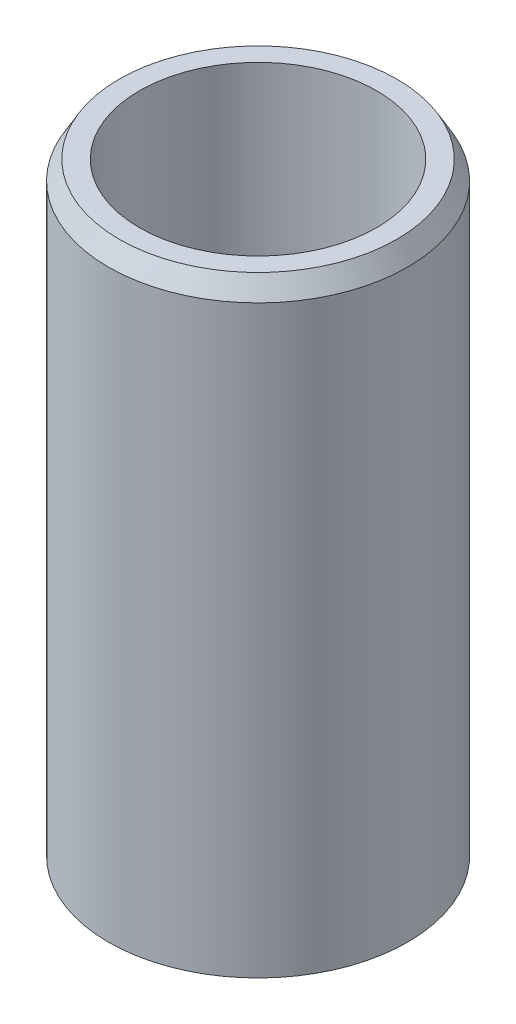
ISO-10303-21;
HEADER;
FILE_DESCRIPTION(('STEP AP214'),'2;1');
FILE_NAME('part.step','',(''),(''),'','','');
FILE_SCHEMA(('AUTOMOTIVE_DESIGN { 1 0 10303 214 1 1 1 1 }'));
ENDSEC;
DATA;
#1=APPLICATION_CONTEXT('core data for automotive mechanical design processes');
#2=APPLICATION_PROTOCOL_DEFINITION('international standard','automotive_design',2000,#1);
#3=PRODUCT_CONTEXT('',#1,'mechanical');
#4=PRODUCT('Part','Part','',(#3));
#5=PRODUCT_RELATED_PRODUCT_CATEGORY('part','',(#4));
#6=PRODUCT_DEFINITION_FORMATION('','',#4);
#7=PRODUCT_DEFINITION_CONTEXT('part definition',#1,'design');
#8=PRODUCT_DEFINITION('design','',#6,#7);
#9=PRODUCT_DEFINITION_SHAPE('','',#8);
#10=(LENGTH_UNIT() NAMED_UNIT(*) SI_UNIT(.MILLI.,.METRE.));
#11=(NAMED_UNIT(*) PLANE_ANGLE_UNIT() SI_UNIT($,.RADIAN.));
#12=(NAMED_UNIT(*) SI_UNIT($,.STERADIAN.) SOLID_ANGLE_UNIT());
#13=UNCERTAINTY_MEASURE_WITH_UNIT(LENGTH_MEASURE(1.E-05),#10,'distance_accuracy_value','');
#14=(GEOMETRIC_REPRESENTATION_CONTEXT(3) GLOBAL_UNCERTAINTY_ASSIGNED_CONTEXT((#13)) GLOBAL_UNIT_ASSIGNED_CONTEXT((#10,
#11,#12)) REPRESENTATION_CONTEXT('',''));
#15=CARTESIAN_POINT('',(0.,0.,0.));
#16=DIRECTION('',(0.,0.,1.));
#17=DIRECTION('',(1.,0.,0.));
#18=AXIS2_PLACEMENT_3D('',#15,#16,#17);
#19=CARTESIAN_POINT('',(0.,174.486426869401,0.));
#20=DIRECTION('',(0.,-1.,0.));
#21=DIRECTION('',(0.,0.,-1.));
#22=AXIS2_PLACEMENT_3D('',#19,#20,#21);
#23=CYLINDRICAL_SURFACE('',#22,42.5);
#24=CARTESIAN_POINT('',(0.,169.170628258907,0.));
#25=DIRECTION('',(0.,1.,0.));
#26=DIRECTION('',(0.,0.,1.));
#27=AXIS2_PLACEMENT_3D('',#24,#25,#26);
#28=CIRCLE('',#27,42.5);
#29=CARTESIAN_POINT('',(0.,169.170628258907,42.5));
#30=VERTEX_POINT('',#29);
#31=EDGE_CURVE('E50',#30,#30,#28,.F.);
#32=ORIENTED_EDGE('',*,*,#31,.T.);
#33=EDGE_LOOP('',(#32));
#34=FACE_BOUND('',#33,.T.);
#35=CARTESIAN_POINT('',(0.,3.06907775872634,0.));
#36=DIRECTION('',(0.,1.,0.));
#37=DIRECTION('',(0.,0.,1.));
#38=AXIS2_PLACEMENT_3D('',#35,#36,#37);
#39=CIRCLE('',#38,42.5);
#40=CARTESIAN_POINT('',(0.,3.06907775872633,42.5));
#41=VERTEX_POINT('',#40);
#42=EDGE_CURVE('E51',#41,#41,#39,.T.);
#43=ORIENTED_EDGE('',*,*,#42,.T.);
#44=EDGE_LOOP('',(#43));
#45=FACE_BOUND('',#44,.T.);
#46=ADVANCED_FACE('F39',(#34,#45),#23,.T.);
#47=CARTESIAN_POINT('',(0.,174.486426869401,0.));
#48=DIRECTION('',(0.,1.,0.));
#49=DIRECTION('',(0.,0.,1.));
#50=AXIS2_PLACEMENT_3D('',#47,#48,#49);
#51=PLANE('',#50);
#52=CARTESIAN_POINT('',(0.,174.486426869401,0.));
#53=DIRECTION('',(0.,1.,0.));
#54=DIRECTION('',(0.,0.,1.));
#55=AXIS2_PLACEMENT_3D('',#52,#53,#54);
#56=CIRCLE('',#55,39.4309222412737);
#57=CARTESIAN_POINT('',(0.,174.486426869401,39.4309222412737));
#58=VERTEX_POINT('',#57);
#59=EDGE_CURVE('E54',#58,#58,#56,.T.);
#60=ORIENTED_EDGE('',*,*,#59,.T.);
#61=EDGE_LOOP('',(#60));
#62=FACE_BOUND('',#61,.T.);
#63=CARTESIAN_POINT('',(0.,174.486426869401,0.));
#64=DIRECTION('',(0.,1.,0.));
#65=DIRECTION('',(0.,0.,1.));
#66=AXIS2_PLACEMENT_3D('',#63,#64,#65);
#67=CIRCLE('',#66,33.7082782274658);
#68=CARTESIAN_POINT('',(0.,174.486426869401,33.7082782274658));
#69=VERTEX_POINT('',#68);
#70=EDGE_CURVE('E58',#69,#69,#67,.T.);
#71=ORIENTED_EDGE('',*,*,#70,.F.);
#72=EDGE_LOOP('',(#71));
#73=FACE_BOUND('',#72,.T.);
#74=ADVANCED_FACE('F69',(#62,#73),#51,.T.);
#75=CARTESIAN_POINT('',(0.,0.,0.));
#76=DIRECTION('',(0.,1.,0.));
#77=DIRECTION('',(0.,0.,1.));
#78=AXIS2_PLACEMENT_3D('',#75,#76,#77);
#79=PLANE('',#78);
#80=CARTESIAN_POINT('',(0.,0.,0.));
#81=DIRECTION('',(0.,1.,0.));
#82=DIRECTION('',(0.,0.,1.));
#83=AXIS2_PLACEMENT_3D('',#80,#81,#82);
#84=CIRCLE('',#83,37.1842013895063);
#85=CARTESIAN_POINT('',(0.,0.,37.1842013895063));
#86=VERTEX_POINT('',#85);
#87=EDGE_CURVE('E10',#86,#86,#84,.F.);
#88=ORIENTED_EDGE('',*,*,#87,.T.);
#89=EDGE_LOOP('',(#88));
#90=FACE_BOUND('',#89,.T.);
#91=CARTESIAN_POINT('',(0.,0.,0.));
#92=DIRECTION('',(0.,1.,0.));
#93=DIRECTION('',(0.,0.,1.));
#94=AXIS2_PLACEMENT_3D('',#91,#92,#93);
#95=CIRCLE('',#94,33.7082782274658);
#96=CARTESIAN_POINT('',(0.,0.,33.7082782274658));
#97=VERTEX_POINT('',#96);
#98=EDGE_CURVE('E63',#97,#97,#95,.T.);
#99=ORIENTED_EDGE('',*,*,#98,.T.);
#100=EDGE_LOOP('',(#99));
#101=FACE_BOUND('',#100,.T.);
#102=ADVANCED_FACE('F75',(#90,#101),#79,.F.);
#103=CARTESIAN_POINT('',(0.,174.486426869401,0.));
#104=DIRECTION('',(0.,-1.,0.));
#105=DIRECTION('',(0.,0.,-1.));
#106=AXIS2_PLACEMENT_3D('',#103,#104,#105);
#107=CYLINDRICAL_SURFACE('',#106,33.7082782274658);
#108=ORIENTED_EDGE('',*,*,#70,.T.);
#109=EDGE_LOOP('',(#108));
#110=FACE_BOUND('',#109,.T.);
#111=ORIENTED_EDGE('',*,*,#98,.F.);
#112=EDGE_LOOP('',(#111));
#113=FACE_BOUND('',#112,.T.);
#114=ADVANCED_FACE('F70',(#110,#113),#107,.F.);
#115=CARTESIAN_POINT('',(0.,174.486426869401,0.));
#116=DIRECTION('',(0.,-1.,0.));
#117=DIRECTION('',(0.,0.,-1.));
#118=AXIS2_PLACEMENT_3D('',#115,#116,#117);
#119=CONICAL_SURFACE('',#118,39.4309222412737,0.523598775598294);
#120=ORIENTED_EDGE('',*,*,#31,.F.);
#121=EDGE_LOOP('',(#120));
#122=FACE_BOUND('',#121,.T.);
#123=ORIENTED_EDGE('',*,*,#59,.F.);
#124=EDGE_LOOP('',(#123));
#125=FACE_BOUND('',#124,.T.);
#126=ADVANCED_FACE('F81',(#122,#125),#119,.T.);
#127=CARTESIAN_POINT('',(0.,3.06907775872634,0.));
#128=DIRECTION('',(0.,1.,0.));
#129=DIRECTION('',(0.,0.,1.));
#130=AXIS2_PLACEMENT_3D('',#127,#128,#129);
#131=CONICAL_SURFACE('',#130,42.5,1.0471975511966);
#132=CARTESIAN_POINT('',(0.,0.,37.1842013895063));
#133=CARTESIAN_POINT('',(0.,0.0319695599867329,37.239574291699));
#134=CARTESIAN_POINT('',(0.,0.0639391199734652,37.2949471938916));
#135=CARTESIAN_POINT('',(0.,0.12787823994693,37.4056929982769));
#136=CARTESIAN_POINT('',(0.,0.159847799933662,37.4610659004696));
#137=CARTESIAN_POINT('',(0.,0.223786919907128,37.5718117048548));
#138=CARTESIAN_POINT('',(0.,0.255756479893861,37.6271846070475));
#139=CARTESIAN_POINT('',(0.,0.319695599867327,37.7379304114328));
#140=CARTESIAN_POINT('',(0.,0.351665159854059,37.7933033136254));
#141=CARTESIAN_POINT('',(0.,0.415604279827524,37.9040491180107));
#142=CARTESIAN_POINT('',(0.,0.447573839814257,37.9594220202033));
#143=CARTESIAN_POINT('',(0.,0.511512959787722,38.0701678245886));
#144=CARTESIAN_POINT('',(0.,0.543482519774455,38.1255407267813));
#145=CARTESIAN_POINT('',(0.,0.60742163974792,38.2362865311665));
#146=CARTESIAN_POINT('',(0.,0.639391199734653,38.2916594333592));
#147=CARTESIAN_POINT('',(0.,0.703330319708118,38.4024052377445));
#148=CARTESIAN_POINT('',(0.,0.735299879694851,38.4577781399371));
#149=CARTESIAN_POINT('',(0.,0.799238999668316,38.5685239443224));
#150=CARTESIAN_POINT('',(0.,0.831208559655049,38.623896846515));
#151=CARTESIAN_POINT('',(0.,0.895147679628514,38.7346426509003));
#152=CARTESIAN_POINT('',(0.,0.927117239615246,38.790015553093));
#153=CARTESIAN_POINT('',(0.,0.991056359588712,38.9007613574783));
#154=CARTESIAN_POINT('',(0.,1.02302591957544,38.9561342596709));
#155=CARTESIAN_POINT('',(0.,1.08696503954891,39.0668800640562));
#156=CARTESIAN_POINT('',(0.,1.11893459953564,39.1222529662488));
#157=CARTESIAN_POINT('',(0.,1.18287371950911,39.2329987706341));
#158=CARTESIAN_POINT('',(0.,1.21484327949584,39.2883716728267));
#159=CARTESIAN_POINT('',(0.,1.27878239946931,39.399117477212));
#160=CARTESIAN_POINT('',(0.,1.31075195945604,39.4544903794047));
#161=CARTESIAN_POINT('',(0.,1.3746910794295,39.56523618379));
#162=CARTESIAN_POINT('',(0.,1.40666063941624,39.6206090859826));
#163=CARTESIAN_POINT('',(0.,1.4705997593897,39.7313548903679));
#164=CARTESIAN_POINT('',(0.,1.50256931937643,39.7867277925605));
#165=CARTESIAN_POINT('',(0.,1.5665084393499,39.8974735969458));
#166=CARTESIAN_POINT('',(0.,1.59847799933663,39.9528464991385));
#167=CARTESIAN_POINT('',(0.,1.6624171193101,40.0635923035237));
#168=CARTESIAN_POINT('',(0.,1.69438667929683,40.1189652057164));
#169=CARTESIAN_POINT('',(0.,1.7583257992703,40.2297110101017));
#170=CARTESIAN_POINT('',(0.,1.79029535925703,40.2850839122943));
#171=CARTESIAN_POINT('',(0.,1.85423447923049,40.3958297166796));
#172=CARTESIAN_POINT('',(0.,1.88620403921723,40.4512026188722));
#173=CARTESIAN_POINT('',(0.,1.95014315919069,40.5619484232575));
#174=CARTESIAN_POINT('',(0.,1.98211271917742,40.6173213254502));
#175=CARTESIAN_POINT('',(0.,2.04605183915089,40.7280671298355));
#176=CARTESIAN_POINT('',(0.,2.07802139913762,40.7834400320281));
#177=CARTESIAN_POINT('',(0.,2.14196051911109,40.8941858364134));
#178=CARTESIAN_POINT('',(0.,2.17393007909782,40.949558738606));
#179=CARTESIAN_POINT('',(0.,2.23786919907129,41.0603045429913));
#180=CARTESIAN_POINT('',(0.,2.26983875905802,41.1156774451839));
#181=CARTESIAN_POINT('',(0.,2.33377787903148,41.2264232495692));
#182=CARTESIAN_POINT('',(0.,2.36574743901822,41.2817961517619));
#183=CARTESIAN_POINT('',(0.,2.42968655899168,41.3925419561472));
#184=CARTESIAN_POINT('',(0.,2.46165611897841,41.4479148583398));
#185=CARTESIAN_POINT('',(0.,2.52559523895188,41.5586606627251));
#186=CARTESIAN_POINT('',(0.,2.55756479893861,41.6140335649177));
#187=CARTESIAN_POINT('',(0.,2.62150391891208,41.724779369303));
#188=CARTESIAN_POINT('',(0.,2.65347347889881,41.7801522714957));
#189=CARTESIAN_POINT('',(0.,2.71741259887228,41.8908980758809));
#190=CARTESIAN_POINT('',(0.,2.74938215885901,41.9462709780736));
#191=CARTESIAN_POINT('',(0.,2.81332127883247,42.0570167824589));
#192=CARTESIAN_POINT('',(0.,2.84529083881921,42.1123896846515));
#193=CARTESIAN_POINT('',(0.,2.90922995879267,42.2231354890368));
#194=CARTESIAN_POINT('',(0.,2.9411995187794,42.2785083912294));
#195=CARTESIAN_POINT('',(0.,3.00513863875287,42.3892541956147));
#196=CARTESIAN_POINT('',(0.,3.0371081987396,42.4446270978074));
#197=CARTESIAN_POINT('',(0.,3.06907775872633,42.5));
#198=B_SPLINE_CURVE_WITH_KNOTS('',3,(#132,#133,#134,#135,#136,#137,#138,#139,#140,#141,#142,
#143,#144,#145,#146,#147,#148,#149,#150,#151,#152,#153,#154,#155,#156,#157,#158,#159,#160,#161,
#162,#163,#164,#165,#166,#167,#168,#169,#170,#171,#172,#173,#174,#175,#176,#177,#178,#179,#180,
#181,#182,#183,#184,#185,#186,#187,#188,#189,#190,#191,#192,#193,#194,#195,#196,#197),
.UNSPECIFIED.,.F.,.F.,(4,2,2,2,2,2,2,2,2,2,2,2,2,2,2,2,2,2,2,2,2,2,2,2,2,2,2,2,2,2,2,2,4),(0.,
0.191817359920398,0.383634719840795,0.575452079761187,0.767269439681585,0.959086799601982,
1.15090415952238,1.34272151944278,1.53453887936318,1.72635623928357,1.91817359920397,
2.10999095912436,2.30180831904476,2.49362567896516,2.68544303888556,2.87726039880595,
3.06907775872635,3.26089511864675,3.45271247856715,3.64452983848754,3.83634719840794,
4.02816455832833,4.21998191824873,4.41179927816913,4.60361663808953,4.79543399800992,
4.98725135793032,5.17906871785072,5.37088607777111,5.56270343769151,5.75452079761191,
5.9463381575323,6.1381555174527),.UNSPECIFIED.);
#199=EDGE_CURVE('BSEAM45',#86,#41,#198,.T.);
#200=ORIENTED_EDGE('',*,*,#87,.F.);
#201=ORIENTED_EDGE('',*,*,#42,.F.);
#202=ORIENTED_EDGE('',*,*,#199,.T.);
#203=ORIENTED_EDGE('',*,*,#199,.F.);
#204=EDGE_LOOP('',(#200,#202,#201,#203));
#205=FACE_BOUND('',#204,.T.);
#206=ADVANCED_FACE('F45',(#205),#131,.T.);
#207=CLOSED_SHELL('',(#46,#74,#102,#114,#126,#206));
#208=MANIFOLD_SOLID_BREP('B2',#207);
#209=ADVANCED_BREP_SHAPE_REPRESENTATION('',(#18,#208),#14);
#210=SHAPE_DEFINITION_REPRESENTATION(#9,#209);
ENDSEC;
END-ISO-10303-21;
